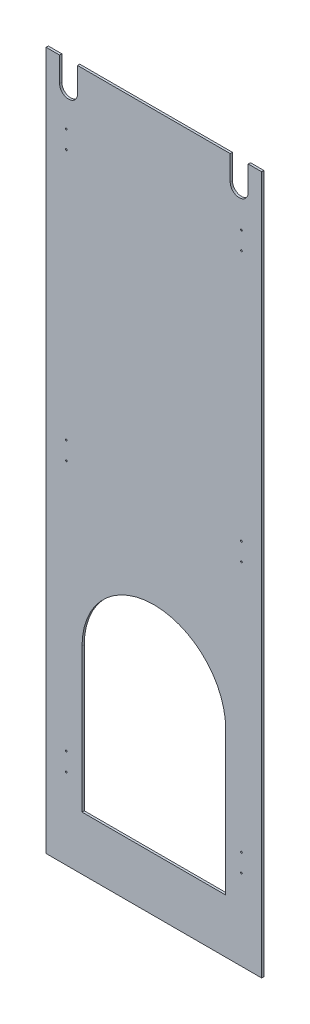
ISO-10303-21;
HEADER;
FILE_DESCRIPTION(('STEP AP214'),'2;1');
FILE_NAME('part.step','',(''),(''),'','','');
FILE_SCHEMA(('AUTOMOTIVE_DESIGN { 1 0 10303 214 1 1 1 1 }'));
ENDSEC;
DATA;
#1=APPLICATION_CONTEXT('core data for automotive mechanical design processes');
#2=APPLICATION_PROTOCOL_DEFINITION('international standard','automotive_design',2000,#1);
#3=PRODUCT_CONTEXT('',#1,'mechanical');
#4=PRODUCT('Part','Part','',(#3));
#5=PRODUCT_RELATED_PRODUCT_CATEGORY('part','',(#4));
#6=PRODUCT_DEFINITION_FORMATION('','',#4);
#7=PRODUCT_DEFINITION_CONTEXT('part definition',#1,'design');
#8=PRODUCT_DEFINITION('design','',#6,#7);
#9=PRODUCT_DEFINITION_SHAPE('','',#8);
#10=(LENGTH_UNIT() NAMED_UNIT(*) SI_UNIT(.MILLI.,.METRE.));
#11=(NAMED_UNIT(*) PLANE_ANGLE_UNIT() SI_UNIT($,.RADIAN.));
#12=(NAMED_UNIT(*) SI_UNIT($,.STERADIAN.) SOLID_ANGLE_UNIT());
#13=UNCERTAINTY_MEASURE_WITH_UNIT(LENGTH_MEASURE(1.E-05),#10,'distance_accuracy_value','');
#14=(GEOMETRIC_REPRESENTATION_CONTEXT(3) GLOBAL_UNCERTAINTY_ASSIGNED_CONTEXT((#13)) GLOBAL_UNIT_ASSIGNED_CONTEXT((#10,
#11,#12)) REPRESENTATION_CONTEXT('',''));
#15=CARTESIAN_POINT('',(0.,0.,0.));
#16=DIRECTION('',(0.,0.,1.));
#17=DIRECTION('',(1.,0.,0.));
#18=AXIS2_PLACEMENT_3D('',#15,#16,#17);
#19=CARTESIAN_POINT('',(0.,0.,0.));
#20=DIRECTION('',(0.,0.,1.));
#21=DIRECTION('',(1.,0.,0.));
#22=AXIS2_PLACEMENT_3D('',#19,#20,#21);
#23=PLANE('',#22);
#24=CARTESIAN_POINT('',(247.65,815.975,0.));
#25=DIRECTION('',(0.,0.,-1.));
#26=DIRECTION('',(-1.,0.,0.));
#27=AXIS2_PLACEMENT_3D('',#24,#25,#26);
#28=CIRCLE('',#27,2.3876);
#29=CARTESIAN_POINT('',(245.2624,815.975,0.));
#30=VERTEX_POINT('',#29);
#31=EDGE_CURVE('E364',#30,#30,#28,.F.);
#32=ORIENTED_EDGE('',*,*,#31,.T.);
#33=EDGE_LOOP('',(#32));
#34=FACE_BOUND('',#33,.T.);
#35=CARTESIAN_POINT('',(247.65,765.175,0.));
#36=DIRECTION('',(0.,0.,-1.));
#37=DIRECTION('',(-1.,0.,0.));
#38=AXIS2_PLACEMENT_3D('',#35,#36,#37);
#39=CIRCLE('',#38,2.3876);
#40=CARTESIAN_POINT('',(245.2624,765.175,0.));
#41=VERTEX_POINT('',#40);
#42=EDGE_CURVE('E367',#41,#41,#39,.F.);
#43=ORIENTED_EDGE('',*,*,#42,.T.);
#44=EDGE_LOOP('',(#43));
#45=FACE_BOUND('',#44,.T.);
#46=CARTESIAN_POINT('',(-247.65,815.975,0.));
#47=DIRECTION('',(0.,0.,-1.));
#48=DIRECTION('',(-1.,0.,0.));
#49=AXIS2_PLACEMENT_3D('',#46,#47,#48);
#50=CIRCLE('',#49,2.3876);
#51=CARTESIAN_POINT('',(-250.0376,815.975,0.));
#52=VERTEX_POINT('',#51);
#53=EDGE_CURVE('E370',#52,#52,#50,.F.);
#54=ORIENTED_EDGE('',*,*,#53,.T.);
#55=EDGE_LOOP('',(#54));
#56=FACE_BOUND('',#55,.T.);
#57=CARTESIAN_POINT('',(-247.65,765.175,0.));
#58=DIRECTION('',(0.,0.,-1.));
#59=DIRECTION('',(-1.,0.,0.));
#60=AXIS2_PLACEMENT_3D('',#57,#58,#59);
#61=CIRCLE('',#60,2.3876);
#62=CARTESIAN_POINT('',(-250.0376,765.175,0.));
#63=VERTEX_POINT('',#62);
#64=EDGE_CURVE('E373',#63,#63,#61,.F.);
#65=ORIENTED_EDGE('',*,*,#64,.T.);
#66=EDGE_LOOP('',(#65));
#67=FACE_BOUND('',#66,.T.);
#68=CARTESIAN_POINT('',(247.65,53.975,0.));
#69=DIRECTION('',(0.,0.,-1.));
#70=DIRECTION('',(-1.,0.,0.));
#71=AXIS2_PLACEMENT_3D('',#68,#69,#70);
#72=CIRCLE('',#71,2.3876);
#73=CARTESIAN_POINT('',(245.2624,53.975,0.));
#74=VERTEX_POINT('',#73);
#75=EDGE_CURVE('E376',#74,#74,#72,.F.);
#76=ORIENTED_EDGE('',*,*,#75,.T.);
#77=EDGE_LOOP('',(#76));
#78=FACE_BOUND('',#77,.T.);
#79=CARTESIAN_POINT('',(247.65,3.175,0.));
#80=DIRECTION('',(0.,0.,-1.));
#81=DIRECTION('',(-1.,0.,0.));
#82=AXIS2_PLACEMENT_3D('',#79,#80,#81);
#83=CIRCLE('',#82,2.3876);
#84=CARTESIAN_POINT('',(245.2624,3.175,0.));
#85=VERTEX_POINT('',#84);
#86=EDGE_CURVE('E379',#85,#85,#83,.F.);
#87=ORIENTED_EDGE('',*,*,#86,.T.);
#88=EDGE_LOOP('',(#87));
#89=FACE_BOUND('',#88,.T.);
#90=CARTESIAN_POINT('',(-247.65,53.975,0.));
#91=DIRECTION('',(0.,0.,-1.));
#92=DIRECTION('',(-1.,0.,0.));
#93=AXIS2_PLACEMENT_3D('',#90,#91,#92);
#94=CIRCLE('',#93,2.3876);
#95=CARTESIAN_POINT('',(-250.0376,53.975,0.));
#96=VERTEX_POINT('',#95);
#97=EDGE_CURVE('E382',#96,#96,#94,.F.);
#98=ORIENTED_EDGE('',*,*,#97,.T.);
#99=EDGE_LOOP('',(#98));
#100=FACE_BOUND('',#99,.T.);
#101=CARTESIAN_POINT('',(-247.65,3.175,0.));
#102=DIRECTION('',(0.,0.,-1.));
#103=DIRECTION('',(-1.,0.,0.));
#104=AXIS2_PLACEMENT_3D('',#101,#102,#103);
#105=CIRCLE('',#104,2.3876);
#106=CARTESIAN_POINT('',(-250.0376,3.175,0.));
#107=VERTEX_POINT('',#106);
#108=EDGE_CURVE('E385',#107,#107,#105,.F.);
#109=ORIENTED_EDGE('',*,*,#108,.T.);
#110=EDGE_LOOP('',(#109));
#111=FACE_BOUND('',#110,.T.);
#112=CARTESIAN_POINT('',(247.65,-708.025,0.));
#113=DIRECTION('',(0.,0.,-1.));
#114=DIRECTION('',(-1.,0.,0.));
#115=AXIS2_PLACEMENT_3D('',#112,#113,#114);
#116=CIRCLE('',#115,2.3876);
#117=CARTESIAN_POINT('',(245.2624,-708.025,0.));
#118=VERTEX_POINT('',#117);
#119=EDGE_CURVE('E388',#118,#118,#116,.F.);
#120=ORIENTED_EDGE('',*,*,#119,.T.);
#121=EDGE_LOOP('',(#120));
#122=FACE_BOUND('',#121,.T.);
#123=CARTESIAN_POINT('',(247.65,-758.825,0.));
#124=DIRECTION('',(0.,0.,-1.));
#125=DIRECTION('',(-1.,0.,0.));
#126=AXIS2_PLACEMENT_3D('',#123,#124,#125);
#127=CIRCLE('',#126,2.3876);
#128=CARTESIAN_POINT('',(245.2624,-758.825,0.));
#129=VERTEX_POINT('',#128);
#130=EDGE_CURVE('E391',#129,#129,#127,.F.);
#131=ORIENTED_EDGE('',*,*,#130,.T.);
#132=EDGE_LOOP('',(#131));
#133=FACE_BOUND('',#132,.T.);
#134=CARTESIAN_POINT('',(-247.65,-708.025,0.));
#135=DIRECTION('',(0.,0.,-1.));
#136=DIRECTION('',(-1.,0.,0.));
#137=AXIS2_PLACEMENT_3D('',#134,#135,#136);
#138=CIRCLE('',#137,2.3876);
#139=CARTESIAN_POINT('',(-250.0376,-708.025,0.));
#140=VERTEX_POINT('',#139);
#141=EDGE_CURVE('E394',#140,#140,#138,.F.);
#142=ORIENTED_EDGE('',*,*,#141,.T.);
#143=EDGE_LOOP('',(#142));
#144=FACE_BOUND('',#143,.T.);
#145=CARTESIAN_POINT('',(-247.65,-758.825,0.));
#146=DIRECTION('',(0.,0.,-1.));
#147=DIRECTION('',(-1.,0.,0.));
#148=AXIS2_PLACEMENT_3D('',#145,#146,#147);
#149=CIRCLE('',#148,2.3876);
#150=CARTESIAN_POINT('',(-250.0376,-758.825,0.));
#151=VERTEX_POINT('',#150);
#152=EDGE_CURVE('E155',#151,#151,#149,.F.);
#153=ORIENTED_EDGE('',*,*,#152,.T.);
#154=EDGE_LOOP('',(#153));
#155=FACE_BOUND('',#154,.T.);
#156=DIRECTION('',(0.,1.,0.));
#157=VECTOR('',#156,1.);
#158=CARTESIAN_POINT('',(-203.2,-428.625,0.));
#159=LINE('',#158,#157);
#160=CARTESIAN_POINT('',(-203.2,-428.625,0.));
#161=VERTEX_POINT('',#160);
#162=CARTESIAN_POINT('',(-203.2,-835.025,0.));
#163=VERTEX_POINT('',#162);
#164=EDGE_CURVE('E205',#161,#163,#159,.F.);
#165=ORIENTED_EDGE('',*,*,#164,.T.);
#166=DIRECTION('',(1.,0.,0.));
#167=VECTOR('',#166,1.);
#168=CARTESIAN_POINT('',(-203.2,-835.025,0.));
#169=LINE('',#168,#167);
#170=CARTESIAN_POINT('',(203.2,-835.025,0.));
#171=VERTEX_POINT('',#170);
#172=EDGE_CURVE('E211',#163,#171,#169,.T.);
#173=ORIENTED_EDGE('',*,*,#172,.T.);
#174=DIRECTION('',(0.,1.,0.));
#175=VECTOR('',#174,1.);
#176=CARTESIAN_POINT('',(203.2,-835.025,0.));
#177=LINE('',#176,#175);
#178=CARTESIAN_POINT('',(203.2,-428.625,0.));
#179=VERTEX_POINT('',#178);
#180=EDGE_CURVE('E154',#171,#179,#177,.T.);
#181=ORIENTED_EDGE('',*,*,#180,.T.);
#182=CARTESIAN_POINT('',(0.,-428.625,0.));
#183=DIRECTION('',(0.,0.,1.));
#184=DIRECTION('',(1.,0.,0.));
#185=AXIS2_PLACEMENT_3D('',#182,#183,#184);
#186=CIRCLE('',#185,203.2);
#187=EDGE_CURVE('E203',#179,#161,#186,.T.);
#188=ORIENTED_EDGE('',*,*,#187,.T.);
#189=EDGE_LOOP('',(#165,#173,#181,#188));
#190=FACE_BOUND('',#189,.T.);
#191=DIRECTION('',(0.,1.,0.));
#192=VECTOR('',#191,1.);
#193=CARTESIAN_POINT('',(304.8,-987.425,0.));
#194=LINE('',#193,#192);
#195=CARTESIAN_POINT('',(304.8,-987.425,0.));
#196=VERTEX_POINT('',#195);
#197=CARTESIAN_POINT('',(304.8,987.425,0.));
#198=VERTEX_POINT('',#197);
#199=EDGE_CURVE('E226',#196,#198,#194,.T.);
#200=ORIENTED_EDGE('',*,*,#199,.F.);
#201=DIRECTION('',(1.,0.,0.));
#202=VECTOR('',#201,1.);
#203=CARTESIAN_POINT('',(-304.8,-987.425,0.));
#204=LINE('',#203,#202);
#205=CARTESIAN_POINT('',(-304.8,-987.425,0.));
#206=VERTEX_POINT('',#205);
#207=EDGE_CURVE('E237',#206,#196,#204,.T.);
#208=ORIENTED_EDGE('',*,*,#207,.F.);
#209=DIRECTION('',(0.,1.,0.));
#210=VECTOR('',#209,1.);
#211=CARTESIAN_POINT('',(-304.8,987.425,0.));
#212=LINE('',#211,#210);
#213=CARTESIAN_POINT('',(-304.8,987.425,0.));
#214=VERTEX_POINT('',#213);
#215=EDGE_CURVE('E248',#214,#206,#212,.F.);
#216=ORIENTED_EDGE('',*,*,#215,.F.);
#217=DIRECTION('',(1.,0.,0.));
#218=VECTOR('',#217,1.);
#219=CARTESIAN_POINT('',(304.8,987.425,0.));
#220=LINE('',#219,#218);
#221=CARTESIAN_POINT('',(-266.7,987.425,0.));
#222=VERTEX_POINT('',#221);
#223=EDGE_CURVE('E267',#222,#214,#220,.F.);
#224=ORIENTED_EDGE('',*,*,#223,.F.);
#225=DIRECTION('',(0.,1.,0.));
#226=VECTOR('',#225,1.);
#227=CARTESIAN_POINT('',(-266.7,917.575,0.));
#228=LINE('',#227,#226);
#229=CARTESIAN_POINT('',(-266.7,917.575,0.));
#230=VERTEX_POINT('',#229);
#231=EDGE_CURVE('E272',#222,#230,#228,.F.);
#232=ORIENTED_EDGE('',*,*,#231,.T.);
#233=CARTESIAN_POINT('',(-241.3,917.575,0.));
#234=DIRECTION('',(0.,0.,-1.));
#235=DIRECTION('',(-1.,0.,0.));
#236=AXIS2_PLACEMENT_3D('',#233,#234,#235);
#237=CIRCLE('',#236,25.4);
#238=CARTESIAN_POINT('',(-215.9,917.575,0.));
#239=VERTEX_POINT('',#238);
#240=EDGE_CURVE('E275',#230,#239,#237,.F.);
#241=ORIENTED_EDGE('',*,*,#240,.T.);
#242=DIRECTION('',(0.,1.,0.));
#243=VECTOR('',#242,1.);
#244=CARTESIAN_POINT('',(-215.9,987.425,0.));
#245=LINE('',#244,#243);
#246=CARTESIAN_POINT('',(-215.9,987.425,0.));
#247=VERTEX_POINT('',#246);
#248=EDGE_CURVE('E278',#239,#247,#245,.T.);
#249=ORIENTED_EDGE('',*,*,#248,.T.);
#250=DIRECTION('',(1.,0.,0.));
#251=VECTOR('',#250,1.);
#252=CARTESIAN_POINT('',(304.8,987.425,0.));
#253=LINE('',#252,#251);
#254=CARTESIAN_POINT('',(215.9,987.425,0.));
#255=VERTEX_POINT('',#254);
#256=EDGE_CURVE('E83',#255,#247,#253,.F.);
#257=ORIENTED_EDGE('',*,*,#256,.F.);
#258=DIRECTION('',(0.,1.,0.));
#259=VECTOR('',#258,1.);
#260=CARTESIAN_POINT('',(215.9,917.575,0.));
#261=LINE('',#260,#259);
#262=CARTESIAN_POINT('',(215.9,917.575,0.));
#263=VERTEX_POINT('',#262);
#264=EDGE_CURVE('E79',#255,#263,#261,.F.);
#265=ORIENTED_EDGE('',*,*,#264,.T.);
#266=CARTESIAN_POINT('',(241.3,917.575,0.));
#267=DIRECTION('',(0.,0.,-1.));
#268=DIRECTION('',(-1.,0.,0.));
#269=AXIS2_PLACEMENT_3D('',#266,#267,#268);
#270=CIRCLE('',#269,25.4);
#271=CARTESIAN_POINT('',(266.7,917.575,0.));
#272=VERTEX_POINT('',#271);
#273=EDGE_CURVE('E20',#263,#272,#270,.F.);
#274=ORIENTED_EDGE('',*,*,#273,.T.);
#275=DIRECTION('',(0.,1.,0.));
#276=VECTOR('',#275,1.);
#277=CARTESIAN_POINT('',(266.7,987.425,0.));
#278=LINE('',#277,#276);
#279=CARTESIAN_POINT('',(266.7,987.425,0.));
#280=VERTEX_POINT('',#279);
#281=EDGE_CURVE('E214',#272,#280,#278,.T.);
#282=ORIENTED_EDGE('',*,*,#281,.T.);
#283=DIRECTION('',(1.,0.,0.));
#284=VECTOR('',#283,1.);
#285=CARTESIAN_POINT('',(304.8,987.425,0.));
#286=LINE('',#285,#284);
#287=EDGE_CURVE('E225',#198,#280,#286,.F.);
#288=ORIENTED_EDGE('',*,*,#287,.F.);
#289=EDGE_LOOP('',(#200,#208,#216,#224,#232,#241,#249,#257,#265,#274,#282,#288));
#290=FACE_BOUND('',#289,.T.);
#291=ADVANCED_FACE('F17',(#34,#45,#56,#67,#78,#89,#100,#111,#122,#133,#144,#155,#190,#290),#23,.F.);
#292=CARTESIAN_POINT('',(241.3,917.575,0.));
#293=DIRECTION('',(0.,0.,-1.));
#294=DIRECTION('',(-1.,0.,0.));
#295=AXIS2_PLACEMENT_3D('',#292,#293,#294);
#296=CYLINDRICAL_SURFACE('',#295,25.4);
#297=CARTESIAN_POINT('',(241.3,917.575,6.35));
#298=DIRECTION('',(0.,0.,-1.));
#299=DIRECTION('',(-1.,0.,0.));
#300=AXIS2_PLACEMENT_3D('',#297,#298,#299);
#301=CIRCLE('',#300,25.4);
#302=CARTESIAN_POINT('',(266.7,917.575,6.35));
#303=VERTEX_POINT('',#302);
#304=CARTESIAN_POINT('',(215.9,917.575,6.35));
#305=VERTEX_POINT('',#304);
#306=EDGE_CURVE('E193',#303,#305,#301,.T.);
#307=ORIENTED_EDGE('',*,*,#306,.F.);
#308=DIRECTION('',(0.,0.,-1.));
#309=VECTOR('',#308,1.);
#310=CARTESIAN_POINT('',(266.7,917.575,0.));
#311=LINE('',#310,#309);
#312=EDGE_CURVE('E208',#303,#272,#311,.T.);
#313=ORIENTED_EDGE('',*,*,#312,.T.);
#314=ORIENTED_EDGE('',*,*,#273,.F.);
#315=DIRECTION('',(0.,0.,1.));
#316=VECTOR('',#315,1.);
#317=CARTESIAN_POINT('',(215.9,917.575,0.));
#318=LINE('',#317,#316);
#319=EDGE_CURVE('E290',#263,#305,#318,.T.);
#320=ORIENTED_EDGE('',*,*,#319,.T.);
#321=EDGE_LOOP('',(#307,#313,#314,#320));
#322=FACE_BOUND('',#321,.T.);
#323=ADVANCED_FACE('F421',(#322),#296,.F.);
#324=CARTESIAN_POINT('',(215.9,917.575,0.));
#325=DIRECTION('',(-1.,0.,0.));
#326=DIRECTION('',(0.,0.,1.));
#327=AXIS2_PLACEMENT_3D('',#324,#325,#326);
#328=PLANE('',#327);
#329=DIRECTION('',(0.,1.,0.));
#330=VECTOR('',#329,1.);
#331=CARTESIAN_POINT('',(215.9,0.,6.35));
#332=LINE('',#331,#330);
#333=CARTESIAN_POINT('',(215.9,987.425,6.35));
#334=VERTEX_POINT('',#333);
#335=EDGE_CURVE('E190',#305,#334,#332,.T.);
#336=ORIENTED_EDGE('',*,*,#335,.F.);
#337=ORIENTED_EDGE('',*,*,#319,.F.);
#338=ORIENTED_EDGE('',*,*,#264,.F.);
#339=DIRECTION('',(0.,0.,1.));
#340=VECTOR('',#339,1.);
#341=CARTESIAN_POINT('',(215.9,987.425,0.));
#342=LINE('',#341,#340);
#343=EDGE_CURVE('E285',#334,#255,#342,.F.);
#344=ORIENTED_EDGE('',*,*,#343,.F.);
#345=EDGE_LOOP('',(#336,#337,#338,#344));
#346=FACE_BOUND('',#345,.T.);
#347=ADVANCED_FACE('F418',(#346),#328,.F.);
#348=CARTESIAN_POINT('',(304.8,987.425,0.));
#349=DIRECTION('',(0.,1.,0.));
#350=DIRECTION('',(0.,0.,1.));
#351=AXIS2_PLACEMENT_3D('',#348,#349,#350);
#352=PLANE('',#351);
#353=DIRECTION('',(1.,0.,0.));
#354=VECTOR('',#353,1.);
#355=CARTESIAN_POINT('',(0.,987.425,6.35));
#356=LINE('',#355,#354);
#357=CARTESIAN_POINT('',(-215.9,987.425,6.35));
#358=VERTEX_POINT('',#357);
#359=EDGE_CURVE('E187',#334,#358,#356,.F.);
#360=ORIENTED_EDGE('',*,*,#359,.F.);
#361=ORIENTED_EDGE('',*,*,#343,.T.);
#362=ORIENTED_EDGE('',*,*,#256,.T.);
#363=DIRECTION('',(0.,0.,-1.));
#364=VECTOR('',#363,1.);
#365=CARTESIAN_POINT('',(-215.9,987.425,0.));
#366=LINE('',#365,#364);
#367=EDGE_CURVE('E276',#247,#358,#366,.F.);
#368=ORIENTED_EDGE('',*,*,#367,.T.);
#369=EDGE_LOOP('',(#360,#361,#362,#368));
#370=FACE_BOUND('',#369,.T.);
#371=ADVANCED_FACE('F416',(#370),#352,.T.);
#372=CARTESIAN_POINT('',(-215.9,987.425,0.));
#373=DIRECTION('',(1.,0.,0.));
#374=DIRECTION('',(0.,0.,-1.));
#375=AXIS2_PLACEMENT_3D('',#372,#373,#374);
#376=PLANE('',#375);
#377=DIRECTION('',(0.,1.,0.));
#378=VECTOR('',#377,1.);
#379=CARTESIAN_POINT('',(-215.9,0.,6.35));
#380=LINE('',#379,#378);
#381=CARTESIAN_POINT('',(-215.9,917.575,6.35));
#382=VERTEX_POINT('',#381);
#383=EDGE_CURVE('E184',#358,#382,#380,.F.);
#384=ORIENTED_EDGE('',*,*,#383,.F.);
#385=ORIENTED_EDGE('',*,*,#367,.F.);
#386=ORIENTED_EDGE('',*,*,#248,.F.);
#387=DIRECTION('',(0.,0.,-1.));
#388=VECTOR('',#387,1.);
#389=CARTESIAN_POINT('',(-215.9,917.575,0.));
#390=LINE('',#389,#388);
#391=EDGE_CURVE('E273',#239,#382,#390,.F.);
#392=ORIENTED_EDGE('',*,*,#391,.T.);
#393=EDGE_LOOP('',(#384,#385,#386,#392));
#394=FACE_BOUND('',#393,.T.);
#395=ADVANCED_FACE('F409',(#394),#376,.F.);
#396=CARTESIAN_POINT('',(-241.3,917.575,0.));
#397=DIRECTION('',(0.,0.,-1.));
#398=DIRECTION('',(-1.,0.,0.));
#399=AXIS2_PLACEMENT_3D('',#396,#397,#398);
#400=CYLINDRICAL_SURFACE('',#399,25.4);
#401=CARTESIAN_POINT('',(-241.3,917.575,6.35));
#402=DIRECTION('',(0.,0.,-1.));
#403=DIRECTION('',(-1.,0.,0.));
#404=AXIS2_PLACEMENT_3D('',#401,#402,#403);
#405=CIRCLE('',#404,25.4);
#406=CARTESIAN_POINT('',(-266.7,917.575,6.35));
#407=VERTEX_POINT('',#406);
#408=EDGE_CURVE('E181',#382,#407,#405,.T.);
#409=ORIENTED_EDGE('',*,*,#408,.F.);
#410=ORIENTED_EDGE('',*,*,#391,.F.);
#411=ORIENTED_EDGE('',*,*,#240,.F.);
#412=DIRECTION('',(0.,0.,1.));
#413=VECTOR('',#412,1.);
#414=CARTESIAN_POINT('',(-266.7,917.575,0.));
#415=LINE('',#414,#413);
#416=EDGE_CURVE('E270',#230,#407,#415,.T.);
#417=ORIENTED_EDGE('',*,*,#416,.T.);
#418=EDGE_LOOP('',(#409,#410,#411,#417));
#419=FACE_BOUND('',#418,.T.);
#420=ADVANCED_FACE('F411',(#419),#400,.F.);
#421=CARTESIAN_POINT('',(-266.7,917.575,0.));
#422=DIRECTION('',(-1.,0.,0.));
#423=DIRECTION('',(0.,0.,1.));
#424=AXIS2_PLACEMENT_3D('',#421,#422,#423);
#425=PLANE('',#424);
#426=DIRECTION('',(0.,1.,0.));
#427=VECTOR('',#426,1.);
#428=CARTESIAN_POINT('',(-266.7,0.,6.35));
#429=LINE('',#428,#427);
#430=CARTESIAN_POINT('',(-266.7,987.425,6.35));
#431=VERTEX_POINT('',#430);
#432=EDGE_CURVE('E177',#407,#431,#429,.T.);
#433=ORIENTED_EDGE('',*,*,#432,.F.);
#434=ORIENTED_EDGE('',*,*,#416,.F.);
#435=ORIENTED_EDGE('',*,*,#231,.F.);
#436=DIRECTION('',(0.,0.,1.));
#437=VECTOR('',#436,1.);
#438=CARTESIAN_POINT('',(-266.7,987.425,0.));
#439=LINE('',#438,#437);
#440=EDGE_CURVE('E258',#431,#222,#439,.F.);
#441=ORIENTED_EDGE('',*,*,#440,.F.);
#442=EDGE_LOOP('',(#433,#434,#435,#441));
#443=FACE_BOUND('',#442,.T.);
#444=ADVANCED_FACE('F447',(#443),#425,.F.);
#445=CARTESIAN_POINT('',(304.8,987.425,0.));
#446=DIRECTION('',(0.,1.,0.));
#447=DIRECTION('',(0.,0.,1.));
#448=AXIS2_PLACEMENT_3D('',#445,#446,#447);
#449=PLANE('',#448);
#450=DIRECTION('',(1.,0.,0.));
#451=VECTOR('',#450,1.);
#452=CARTESIAN_POINT('',(0.,987.425,6.35));
#453=LINE('',#452,#451);
#454=CARTESIAN_POINT('',(-304.8,987.425,6.35));
#455=VERTEX_POINT('',#454);
#456=EDGE_CURVE('E180',#431,#455,#453,.F.);
#457=ORIENTED_EDGE('',*,*,#456,.F.);
#458=ORIENTED_EDGE('',*,*,#440,.T.);
#459=ORIENTED_EDGE('',*,*,#223,.T.);
#460=DIRECTION('',(0.,0.,1.));
#461=VECTOR('',#460,1.);
#462=CARTESIAN_POINT('',(-304.8,987.425,0.));
#463=LINE('',#462,#461);
#464=EDGE_CURVE('E255',#455,#214,#463,.F.);
#465=ORIENTED_EDGE('',*,*,#464,.F.);
#466=EDGE_LOOP('',(#457,#458,#459,#465));
#467=FACE_BOUND('',#466,.T.);
#468=ADVANCED_FACE('F445',(#467),#449,.T.);
#469=CARTESIAN_POINT('',(-304.8,987.425,0.));
#470=DIRECTION('',(-1.,0.,0.));
#471=DIRECTION('',(0.,0.,1.));
#472=AXIS2_PLACEMENT_3D('',#469,#470,#471);
#473=PLANE('',#472);
#474=ORIENTED_EDGE('',*,*,#464,.T.);
#475=ORIENTED_EDGE('',*,*,#215,.T.);
#476=DIRECTION('',(0.,0.,-1.));
#477=VECTOR('',#476,1.);
#478=CARTESIAN_POINT('',(-304.8,-987.425,0.));
#479=LINE('',#478,#477);
#480=CARTESIAN_POINT('',(-304.8,-987.425,6.35));
#481=VERTEX_POINT('',#480);
#482=EDGE_CURVE('E245',#481,#206,#479,.T.);
#483=ORIENTED_EDGE('',*,*,#482,.F.);
#484=DIRECTION('',(0.,1.,0.));
#485=VECTOR('',#484,1.);
#486=CARTESIAN_POINT('',(-304.8,0.,6.35));
#487=LINE('',#486,#485);
#488=EDGE_CURVE('E242',#455,#481,#487,.F.);
#489=ORIENTED_EDGE('',*,*,#488,.F.);
#490=EDGE_LOOP('',(#474,#475,#483,#489));
#491=FACE_BOUND('',#490,.T.);
#492=ADVANCED_FACE('F442',(#491),#473,.T.);
#493=CARTESIAN_POINT('',(-304.8,-987.425,0.));
#494=DIRECTION('',(0.,-1.,0.));
#495=DIRECTION('',(0.,0.,-1.));
#496=AXIS2_PLACEMENT_3D('',#493,#494,#495);
#497=PLANE('',#496);
#498=ORIENTED_EDGE('',*,*,#482,.T.);
#499=ORIENTED_EDGE('',*,*,#207,.T.);
#500=DIRECTION('',(0.,0.,-1.));
#501=VECTOR('',#500,1.);
#502=CARTESIAN_POINT('',(304.8,-987.425,0.));
#503=LINE('',#502,#501);
#504=CARTESIAN_POINT('',(304.8,-987.425,6.35));
#505=VERTEX_POINT('',#504);
#506=EDGE_CURVE('E234',#505,#196,#503,.T.);
#507=ORIENTED_EDGE('',*,*,#506,.F.);
#508=DIRECTION('',(1.,0.,0.));
#509=VECTOR('',#508,1.);
#510=CARTESIAN_POINT('',(0.,-987.425,6.35));
#511=LINE('',#510,#509);
#512=EDGE_CURVE('E231',#481,#505,#511,.T.);
#513=ORIENTED_EDGE('',*,*,#512,.F.);
#514=EDGE_LOOP('',(#498,#499,#507,#513));
#515=FACE_BOUND('',#514,.T.);
#516=ADVANCED_FACE('F439',(#515),#497,.T.);
#517=CARTESIAN_POINT('',(304.8,-987.425,0.));
#518=DIRECTION('',(1.,0.,0.));
#519=DIRECTION('',(0.,0.,-1.));
#520=AXIS2_PLACEMENT_3D('',#517,#518,#519);
#521=PLANE('',#520);
#522=ORIENTED_EDGE('',*,*,#506,.T.);
#523=ORIENTED_EDGE('',*,*,#199,.T.);
#524=DIRECTION('',(0.,0.,1.));
#525=VECTOR('',#524,1.);
#526=CARTESIAN_POINT('',(304.8,987.425,0.));
#527=LINE('',#526,#525);
#528=CARTESIAN_POINT('',(304.8,987.425,6.35));
#529=VERTEX_POINT('',#528);
#530=EDGE_CURVE('E222',#529,#198,#527,.F.);
#531=ORIENTED_EDGE('',*,*,#530,.F.);
#532=DIRECTION('',(0.,1.,0.));
#533=VECTOR('',#532,1.);
#534=CARTESIAN_POINT('',(304.8,0.,6.35));
#535=LINE('',#534,#533);
#536=EDGE_CURVE('E219',#505,#529,#535,.T.);
#537=ORIENTED_EDGE('',*,*,#536,.F.);
#538=EDGE_LOOP('',(#522,#523,#531,#537));
#539=FACE_BOUND('',#538,.T.);
#540=ADVANCED_FACE('F435',(#539),#521,.T.);
#541=CARTESIAN_POINT('',(304.8,987.425,0.));
#542=DIRECTION('',(0.,1.,0.));
#543=DIRECTION('',(0.,0.,1.));
#544=AXIS2_PLACEMENT_3D('',#541,#542,#543);
#545=PLANE('',#544);
#546=ORIENTED_EDGE('',*,*,#287,.T.);
#547=DIRECTION('',(0.,0.,-1.));
#548=VECTOR('',#547,1.);
#549=CARTESIAN_POINT('',(266.7,987.425,0.));
#550=LINE('',#549,#548);
#551=CARTESIAN_POINT('',(266.7,987.425,6.35));
#552=VERTEX_POINT('',#551);
#553=EDGE_CURVE('E212',#280,#552,#550,.F.);
#554=ORIENTED_EDGE('',*,*,#553,.T.);
#555=DIRECTION('',(1.,0.,0.));
#556=VECTOR('',#555,1.);
#557=CARTESIAN_POINT('',(0.,987.425,6.35));
#558=LINE('',#557,#556);
#559=EDGE_CURVE('E174',#529,#552,#558,.F.);
#560=ORIENTED_EDGE('',*,*,#559,.F.);
#561=ORIENTED_EDGE('',*,*,#530,.T.);
#562=EDGE_LOOP('',(#546,#554,#560,#561));
#563=FACE_BOUND('',#562,.T.);
#564=ADVANCED_FACE('F428',(#563),#545,.T.);
#565=CARTESIAN_POINT('',(266.7,987.425,0.));
#566=DIRECTION('',(1.,0.,0.));
#567=DIRECTION('',(0.,0.,-1.));
#568=AXIS2_PLACEMENT_3D('',#565,#566,#567);
#569=PLANE('',#568);
#570=DIRECTION('',(0.,1.,0.));
#571=VECTOR('',#570,1.);
#572=CARTESIAN_POINT('',(266.7,0.,6.35));
#573=LINE('',#572,#571);
#574=EDGE_CURVE('E148',#552,#303,#573,.F.);
#575=ORIENTED_EDGE('',*,*,#574,.F.);
#576=ORIENTED_EDGE('',*,*,#553,.F.);
#577=ORIENTED_EDGE('',*,*,#281,.F.);
#578=ORIENTED_EDGE('',*,*,#312,.F.);
#579=EDGE_LOOP('',(#575,#576,#577,#578));
#580=FACE_BOUND('',#579,.T.);
#581=ADVANCED_FACE('F431',(#580),#569,.F.);
#582=CARTESIAN_POINT('',(-203.2,-835.025,6.35));
#583=DIRECTION('',(0.,-1.,0.));
#584=DIRECTION('',(0.,0.,-1.));
#585=AXIS2_PLACEMENT_3D('',#582,#583,#584);
#586=PLANE('',#585);
#587=DIRECTION('',(1.,0.,0.));
#588=VECTOR('',#587,1.);
#589=CARTESIAN_POINT('',(0.,-835.025,6.35));
#590=LINE('',#589,#588);
#591=CARTESIAN_POINT('',(203.2,-835.025,6.35));
#592=VERTEX_POINT('',#591);
#593=CARTESIAN_POINT('',(-203.2,-835.025,6.35));
#594=VERTEX_POINT('',#593);
#595=EDGE_CURVE('E135',#592,#594,#590,.F.);
#596=ORIENTED_EDGE('',*,*,#595,.F.);
#597=DIRECTION('',(0.,0.,-1.));
#598=VECTOR('',#597,1.);
#599=CARTESIAN_POINT('',(203.2,-835.025,6.35));
#600=LINE('',#599,#598);
#601=EDGE_CURVE('E139',#592,#171,#600,.T.);
#602=ORIENTED_EDGE('',*,*,#601,.T.);
#603=ORIENTED_EDGE('',*,*,#172,.F.);
#604=DIRECTION('',(0.,0.,1.));
#605=VECTOR('',#604,1.);
#606=CARTESIAN_POINT('',(-203.2,-835.025,6.35));
#607=LINE('',#606,#605);
#608=EDGE_CURVE('E142',#163,#594,#607,.T.);
#609=ORIENTED_EDGE('',*,*,#608,.T.);
#610=EDGE_LOOP('',(#596,#602,#603,#609));
#611=FACE_BOUND('',#610,.T.);
#612=ADVANCED_FACE('F137',(#611),#586,.F.);
#613=CARTESIAN_POINT('',(-203.2,-428.625,6.35));
#614=DIRECTION('',(-1.,0.,0.));
#615=DIRECTION('',(0.,0.,1.));
#616=AXIS2_PLACEMENT_3D('',#613,#614,#615);
#617=PLANE('',#616);
#618=DIRECTION('',(0.,1.,0.));
#619=VECTOR('',#618,1.);
#620=CARTESIAN_POINT('',(-203.2,0.,6.35));
#621=LINE('',#620,#619);
#622=CARTESIAN_POINT('',(-203.2,-428.625,6.35));
#623=VERTEX_POINT('',#622);
#624=EDGE_CURVE('E147',#594,#623,#621,.T.);
#625=ORIENTED_EDGE('',*,*,#624,.F.);
#626=ORIENTED_EDGE('',*,*,#608,.F.);
#627=ORIENTED_EDGE('',*,*,#164,.F.);
#628=DIRECTION('',(0.,0.,1.));
#629=VECTOR('',#628,1.);
#630=CARTESIAN_POINT('',(-203.2,-428.625,6.35));
#631=LINE('',#630,#629);
#632=EDGE_CURVE('E201',#161,#623,#631,.T.);
#633=ORIENTED_EDGE('',*,*,#632,.T.);
#634=EDGE_LOOP('',(#625,#626,#627,#633));
#635=FACE_BOUND('',#634,.T.);
#636=ADVANCED_FACE('F517',(#635),#617,.F.);
#637=CARTESIAN_POINT('',(0.,-428.625,6.35));
#638=DIRECTION('',(0.,0.,1.));
#639=DIRECTION('',(1.,0.,0.));
#640=AXIS2_PLACEMENT_3D('',#637,#638,#639);
#641=CYLINDRICAL_SURFACE('',#640,203.2);
#642=CARTESIAN_POINT('',(0.,-428.625,6.35));
#643=DIRECTION('',(0.,0.,1.));
#644=DIRECTION('',(1.,0.,0.));
#645=AXIS2_PLACEMENT_3D('',#642,#643,#644);
#646=CIRCLE('',#645,203.2);
#647=CARTESIAN_POINT('',(203.2,-428.625,6.35));
#648=VERTEX_POINT('',#647);
#649=EDGE_CURVE('E159',#623,#648,#646,.F.);
#650=ORIENTED_EDGE('',*,*,#649,.F.);
#651=ORIENTED_EDGE('',*,*,#632,.F.);
#652=ORIENTED_EDGE('',*,*,#187,.F.);
#653=DIRECTION('',(0.,0.,-1.));
#654=VECTOR('',#653,1.);
#655=CARTESIAN_POINT('',(203.2,-428.625,6.35));
#656=LINE('',#655,#654);
#657=EDGE_CURVE('E35',#179,#648,#656,.F.);
#658=ORIENTED_EDGE('',*,*,#657,.T.);
#659=EDGE_LOOP('',(#650,#651,#652,#658));
#660=FACE_BOUND('',#659,.T.);
#661=ADVANCED_FACE('F514',(#660),#641,.F.);
#662=CARTESIAN_POINT('',(203.2,-835.025,6.35));
#663=DIRECTION('',(1.,0.,0.));
#664=DIRECTION('',(0.,0.,-1.));
#665=AXIS2_PLACEMENT_3D('',#662,#663,#664);
#666=PLANE('',#665);
#667=DIRECTION('',(0.,1.,0.));
#668=VECTOR('',#667,1.);
#669=CARTESIAN_POINT('',(203.2,0.,6.35));
#670=LINE('',#669,#668);
#671=EDGE_CURVE('E152',#648,#592,#670,.F.);
#672=ORIENTED_EDGE('',*,*,#671,.F.);
#673=ORIENTED_EDGE('',*,*,#657,.F.);
#674=ORIENTED_EDGE('',*,*,#180,.F.);
#675=ORIENTED_EDGE('',*,*,#601,.F.);
#676=EDGE_LOOP('',(#672,#673,#674,#675));
#677=FACE_BOUND('',#676,.T.);
#678=ADVANCED_FACE('F151',(#677),#666,.F.);
#679=CARTESIAN_POINT('',(-247.65,-758.825,0.));
#680=DIRECTION('',(0.,0.,-1.));
#681=DIRECTION('',(-1.,0.,0.));
#682=AXIS2_PLACEMENT_3D('',#679,#680,#681);
#683=CYLINDRICAL_SURFACE('',#682,2.3876);
#684=CARTESIAN_POINT('',(-247.65,-758.825,6.35));
#685=DIRECTION('',(0.,0.,-1.));
#686=DIRECTION('',(-1.,0.,0.));
#687=AXIS2_PLACEMENT_3D('',#684,#685,#686);
#688=CIRCLE('',#687,2.3876);
#689=CARTESIAN_POINT('',(-250.0376,-758.825,6.35));
#690=VERTEX_POINT('',#689);
#691=EDGE_CURVE('E160',#690,#690,#688,.T.);
#692=ORIENTED_EDGE('',*,*,#691,.F.);
#693=EDGE_LOOP('',(#692));
#694=FACE_BOUND('',#693,.T.);
#695=ORIENTED_EDGE('',*,*,#152,.F.);
#696=EDGE_LOOP('',(#695));
#697=FACE_BOUND('',#696,.T.);
#698=ADVANCED_FACE('F507',(#694,#697),#683,.F.);
#699=CARTESIAN_POINT('',(-247.65,-708.025,0.));
#700=DIRECTION('',(0.,0.,-1.));
#701=DIRECTION('',(-1.,0.,0.));
#702=AXIS2_PLACEMENT_3D('',#699,#700,#701);
#703=CYLINDRICAL_SURFACE('',#702,2.3876);
#704=CARTESIAN_POINT('',(-247.65,-708.025,6.35));
#705=DIRECTION('',(0.,0.,-1.));
#706=DIRECTION('',(-1.,0.,0.));
#707=AXIS2_PLACEMENT_3D('',#704,#705,#706);
#708=CIRCLE('',#707,2.3876);
#709=CARTESIAN_POINT('',(-250.0376,-708.025,6.35));
#710=VERTEX_POINT('',#709);
#711=EDGE_CURVE('E163',#710,#710,#708,.T.);
#712=ORIENTED_EDGE('',*,*,#711,.F.);
#713=EDGE_LOOP('',(#712));
#714=FACE_BOUND('',#713,.T.);
#715=ORIENTED_EDGE('',*,*,#141,.F.);
#716=EDGE_LOOP('',(#715));
#717=FACE_BOUND('',#716,.T.);
#718=ADVANCED_FACE('F503',(#714,#717),#703,.F.);
#719=CARTESIAN_POINT('',(247.65,-758.825,0.));
#720=DIRECTION('',(0.,0.,-1.));
#721=DIRECTION('',(-1.,0.,0.));
#722=AXIS2_PLACEMENT_3D('',#719,#720,#721);
#723=CYLINDRICAL_SURFACE('',#722,2.3876);
#724=CARTESIAN_POINT('',(247.65,-758.825,6.35));
#725=DIRECTION('',(0.,0.,-1.));
#726=DIRECTION('',(-1.,0.,0.));
#727=AXIS2_PLACEMENT_3D('',#724,#725,#726);
#728=CIRCLE('',#727,2.3876);
#729=CARTESIAN_POINT('',(245.2624,-758.825,6.35));
#730=VERTEX_POINT('',#729);
#731=EDGE_CURVE('E355',#730,#730,#728,.T.);
#732=ORIENTED_EDGE('',*,*,#731,.F.);
#733=EDGE_LOOP('',(#732));
#734=FACE_BOUND('',#733,.T.);
#735=ORIENTED_EDGE('',*,*,#130,.F.);
#736=EDGE_LOOP('',(#735));
#737=FACE_BOUND('',#736,.T.);
#738=ADVANCED_FACE('F499',(#734,#737),#723,.F.);
#739=CARTESIAN_POINT('',(247.65,-708.025,0.));
#740=DIRECTION('',(0.,0.,-1.));
#741=DIRECTION('',(-1.,0.,0.));
#742=AXIS2_PLACEMENT_3D('',#739,#740,#741);
#743=CYLINDRICAL_SURFACE('',#742,2.3876);
#744=CARTESIAN_POINT('',(247.65,-708.025,6.35));
#745=DIRECTION('',(0.,0.,-1.));
#746=DIRECTION('',(-1.,0.,0.));
#747=AXIS2_PLACEMENT_3D('',#744,#745,#746);
#748=CIRCLE('',#747,2.3876);
#749=CARTESIAN_POINT('',(245.2624,-708.025,6.35));
#750=VERTEX_POINT('',#749);
#751=EDGE_CURVE('E352',#750,#750,#748,.T.);
#752=ORIENTED_EDGE('',*,*,#751,.F.);
#753=EDGE_LOOP('',(#752));
#754=FACE_BOUND('',#753,.T.);
#755=ORIENTED_EDGE('',*,*,#119,.F.);
#756=EDGE_LOOP('',(#755));
#757=FACE_BOUND('',#756,.T.);
#758=ADVANCED_FACE('F495',(#754,#757),#743,.F.);
#759=CARTESIAN_POINT('',(-247.65,3.175,0.));
#760=DIRECTION('',(0.,0.,-1.));
#761=DIRECTION('',(-1.,0.,0.));
#762=AXIS2_PLACEMENT_3D('',#759,#760,#761);
#763=CYLINDRICAL_SURFACE('',#762,2.3876);
#764=CARTESIAN_POINT('',(-247.65,3.175,6.35));
#765=DIRECTION('',(0.,0.,-1.));
#766=DIRECTION('',(-1.,0.,0.));
#767=AXIS2_PLACEMENT_3D('',#764,#765,#766);
#768=CIRCLE('',#767,2.3876);
#769=CARTESIAN_POINT('',(-250.0376,3.175,6.35));
#770=VERTEX_POINT('',#769);
#771=EDGE_CURVE('E349',#770,#770,#768,.T.);
#772=ORIENTED_EDGE('',*,*,#771,.F.);
#773=EDGE_LOOP('',(#772));
#774=FACE_BOUND('',#773,.T.);
#775=ORIENTED_EDGE('',*,*,#108,.F.);
#776=EDGE_LOOP('',(#775));
#777=FACE_BOUND('',#776,.T.);
#778=ADVANCED_FACE('F491',(#774,#777),#763,.F.);
#779=CARTESIAN_POINT('',(-247.65,53.975,0.));
#780=DIRECTION('',(0.,0.,-1.));
#781=DIRECTION('',(-1.,0.,0.));
#782=AXIS2_PLACEMENT_3D('',#779,#780,#781);
#783=CYLINDRICAL_SURFACE('',#782,2.3876);
#784=CARTESIAN_POINT('',(-247.65,53.975,6.35));
#785=DIRECTION('',(0.,0.,-1.));
#786=DIRECTION('',(-1.,0.,0.));
#787=AXIS2_PLACEMENT_3D('',#784,#785,#786);
#788=CIRCLE('',#787,2.3876);
#789=CARTESIAN_POINT('',(-250.0376,53.975,6.35));
#790=VERTEX_POINT('',#789);
#791=EDGE_CURVE('E346',#790,#790,#788,.T.);
#792=ORIENTED_EDGE('',*,*,#791,.F.);
#793=EDGE_LOOP('',(#792));
#794=FACE_BOUND('',#793,.T.);
#795=ORIENTED_EDGE('',*,*,#97,.F.);
#796=EDGE_LOOP('',(#795));
#797=FACE_BOUND('',#796,.T.);
#798=ADVANCED_FACE('F487',(#794,#797),#783,.F.);
#799=CARTESIAN_POINT('',(247.65,3.175,0.));
#800=DIRECTION('',(0.,0.,-1.));
#801=DIRECTION('',(-1.,0.,0.));
#802=AXIS2_PLACEMENT_3D('',#799,#800,#801);
#803=CYLINDRICAL_SURFACE('',#802,2.3876);
#804=CARTESIAN_POINT('',(247.65,3.175,6.35));
#805=DIRECTION('',(0.,0.,-1.));
#806=DIRECTION('',(-1.,0.,0.));
#807=AXIS2_PLACEMENT_3D('',#804,#805,#806);
#808=CIRCLE('',#807,2.3876);
#809=CARTESIAN_POINT('',(245.2624,3.175,6.35));
#810=VERTEX_POINT('',#809);
#811=EDGE_CURVE('E343',#810,#810,#808,.T.);
#812=ORIENTED_EDGE('',*,*,#811,.F.);
#813=EDGE_LOOP('',(#812));
#814=FACE_BOUND('',#813,.T.);
#815=ORIENTED_EDGE('',*,*,#86,.F.);
#816=EDGE_LOOP('',(#815));
#817=FACE_BOUND('',#816,.T.);
#818=ADVANCED_FACE('F483',(#814,#817),#803,.F.);
#819=CARTESIAN_POINT('',(247.65,53.975,0.));
#820=DIRECTION('',(0.,0.,-1.));
#821=DIRECTION('',(-1.,0.,0.));
#822=AXIS2_PLACEMENT_3D('',#819,#820,#821);
#823=CYLINDRICAL_SURFACE('',#822,2.3876);
#824=CARTESIAN_POINT('',(247.65,53.975,6.35));
#825=DIRECTION('',(0.,0.,-1.));
#826=DIRECTION('',(-1.,0.,0.));
#827=AXIS2_PLACEMENT_3D('',#824,#825,#826);
#828=CIRCLE('',#827,2.3876);
#829=CARTESIAN_POINT('',(245.2624,53.975,6.35));
#830=VERTEX_POINT('',#829);
#831=EDGE_CURVE('E340',#830,#830,#828,.T.);
#832=ORIENTED_EDGE('',*,*,#831,.F.);
#833=EDGE_LOOP('',(#832));
#834=FACE_BOUND('',#833,.T.);
#835=ORIENTED_EDGE('',*,*,#75,.F.);
#836=EDGE_LOOP('',(#835));
#837=FACE_BOUND('',#836,.T.);
#838=ADVANCED_FACE('F479',(#834,#837),#823,.F.);
#839=CARTESIAN_POINT('',(-247.65,765.175,0.));
#840=DIRECTION('',(0.,0.,-1.));
#841=DIRECTION('',(-1.,0.,0.));
#842=AXIS2_PLACEMENT_3D('',#839,#840,#841);
#843=CYLINDRICAL_SURFACE('',#842,2.3876);
#844=CARTESIAN_POINT('',(-247.65,765.175,6.35));
#845=DIRECTION('',(0.,0.,-1.));
#846=DIRECTION('',(-1.,0.,0.));
#847=AXIS2_PLACEMENT_3D('',#844,#845,#846);
#848=CIRCLE('',#847,2.3876);
#849=CARTESIAN_POINT('',(-250.0376,765.175,6.35));
#850=VERTEX_POINT('',#849);
#851=EDGE_CURVE('E337',#850,#850,#848,.T.);
#852=ORIENTED_EDGE('',*,*,#851,.F.);
#853=EDGE_LOOP('',(#852));
#854=FACE_BOUND('',#853,.T.);
#855=ORIENTED_EDGE('',*,*,#64,.F.);
#856=EDGE_LOOP('',(#855));
#857=FACE_BOUND('',#856,.T.);
#858=ADVANCED_FACE('F475',(#854,#857),#843,.F.);
#859=CARTESIAN_POINT('',(-247.65,815.975,0.));
#860=DIRECTION('',(0.,0.,-1.));
#861=DIRECTION('',(-1.,0.,0.));
#862=AXIS2_PLACEMENT_3D('',#859,#860,#861);
#863=CYLINDRICAL_SURFACE('',#862,2.3876);
#864=CARTESIAN_POINT('',(-247.65,815.975,6.35));
#865=DIRECTION('',(0.,0.,-1.));
#866=DIRECTION('',(-1.,0.,0.));
#867=AXIS2_PLACEMENT_3D('',#864,#865,#866);
#868=CIRCLE('',#867,2.3876);
#869=CARTESIAN_POINT('',(-250.0376,815.975,6.35));
#870=VERTEX_POINT('',#869);
#871=EDGE_CURVE('E334',#870,#870,#868,.T.);
#872=ORIENTED_EDGE('',*,*,#871,.F.);
#873=EDGE_LOOP('',(#872));
#874=FACE_BOUND('',#873,.T.);
#875=ORIENTED_EDGE('',*,*,#53,.F.);
#876=EDGE_LOOP('',(#875));
#877=FACE_BOUND('',#876,.T.);
#878=ADVANCED_FACE('F471',(#874,#877),#863,.F.);
#879=CARTESIAN_POINT('',(247.65,765.175,0.));
#880=DIRECTION('',(0.,0.,-1.));
#881=DIRECTION('',(-1.,0.,0.));
#882=AXIS2_PLACEMENT_3D('',#879,#880,#881);
#883=CYLINDRICAL_SURFACE('',#882,2.3876);
#884=CARTESIAN_POINT('',(247.65,765.175,6.35));
#885=DIRECTION('',(0.,0.,-1.));
#886=DIRECTION('',(-1.,0.,0.));
#887=AXIS2_PLACEMENT_3D('',#884,#885,#886);
#888=CIRCLE('',#887,2.3876);
#889=CARTESIAN_POINT('',(245.2624,765.175,6.35));
#890=VERTEX_POINT('',#889);
#891=EDGE_CURVE('E26',#890,#890,#888,.T.);
#892=ORIENTED_EDGE('',*,*,#891,.F.);
#893=EDGE_LOOP('',(#892));
#894=FACE_BOUND('',#893,.T.);
#895=ORIENTED_EDGE('',*,*,#42,.F.);
#896=EDGE_LOOP('',(#895));
#897=FACE_BOUND('',#896,.T.);
#898=ADVANCED_FACE('F464',(#894,#897),#883,.F.);
#899=CARTESIAN_POINT('',(247.65,815.975,0.));
#900=DIRECTION('',(0.,0.,-1.));
#901=DIRECTION('',(-1.,0.,0.));
#902=AXIS2_PLACEMENT_3D('',#899,#900,#901);
#903=CYLINDRICAL_SURFACE('',#902,2.3876);
#904=CARTESIAN_POINT('',(247.65,815.975,6.35));
#905=DIRECTION('',(0.,0.,-1.));
#906=DIRECTION('',(-1.,0.,0.));
#907=AXIS2_PLACEMENT_3D('',#904,#905,#906);
#908=CIRCLE('',#907,2.3876);
#909=CARTESIAN_POINT('',(245.2624,815.975,6.35));
#910=VERTEX_POINT('',#909);
#911=EDGE_CURVE('E11',#910,#910,#908,.T.);
#912=ORIENTED_EDGE('',*,*,#911,.F.);
#913=EDGE_LOOP('',(#912));
#914=FACE_BOUND('',#913,.T.);
#915=ORIENTED_EDGE('',*,*,#31,.F.);
#916=EDGE_LOOP('',(#915));
#917=FACE_BOUND('',#916,.T.);
#918=ADVANCED_FACE('F458',(#914,#917),#903,.F.);
#919=CARTESIAN_POINT('',(0.,0.,6.35));
#920=DIRECTION('',(0.,0.,1.));
#921=DIRECTION('',(1.,0.,0.));
#922=AXIS2_PLACEMENT_3D('',#919,#920,#921);
#923=PLANE('',#922);
#924=ORIENTED_EDGE('',*,*,#911,.T.);
#925=EDGE_LOOP('',(#924));
#926=FACE_BOUND('',#925,.T.);
#927=ORIENTED_EDGE('',*,*,#891,.T.);
#928=EDGE_LOOP('',(#927));
#929=FACE_BOUND('',#928,.T.);
#930=ORIENTED_EDGE('',*,*,#871,.T.);
#931=EDGE_LOOP('',(#930));
#932=FACE_BOUND('',#931,.T.);
#933=ORIENTED_EDGE('',*,*,#851,.T.);
#934=EDGE_LOOP('',(#933));
#935=FACE_BOUND('',#934,.T.);
#936=ORIENTED_EDGE('',*,*,#831,.T.);
#937=EDGE_LOOP('',(#936));
#938=FACE_BOUND('',#937,.T.);
#939=ORIENTED_EDGE('',*,*,#811,.T.);
#940=EDGE_LOOP('',(#939));
#941=FACE_BOUND('',#940,.T.);
#942=ORIENTED_EDGE('',*,*,#791,.T.);
#943=EDGE_LOOP('',(#942));
#944=FACE_BOUND('',#943,.T.);
#945=ORIENTED_EDGE('',*,*,#771,.T.);
#946=EDGE_LOOP('',(#945));
#947=FACE_BOUND('',#946,.T.);
#948=ORIENTED_EDGE('',*,*,#751,.T.);
#949=EDGE_LOOP('',(#948));
#950=FACE_BOUND('',#949,.T.);
#951=ORIENTED_EDGE('',*,*,#731,.T.);
#952=EDGE_LOOP('',(#951));
#953=FACE_BOUND('',#952,.T.);
#954=ORIENTED_EDGE('',*,*,#711,.T.);
#955=EDGE_LOOP('',(#954));
#956=FACE_BOUND('',#955,.T.);
#957=ORIENTED_EDGE('',*,*,#691,.T.);
#958=EDGE_LOOP('',(#957));
#959=FACE_BOUND('',#958,.T.);
#960=ORIENTED_EDGE('',*,*,#649,.T.);
#961=ORIENTED_EDGE('',*,*,#671,.T.);
#962=ORIENTED_EDGE('',*,*,#595,.T.);
#963=ORIENTED_EDGE('',*,*,#624,.T.);
#964=EDGE_LOOP('',(#960,#961,#962,#963));
#965=FACE_BOUND('',#964,.T.);
#966=ORIENTED_EDGE('',*,*,#559,.T.);
#967=ORIENTED_EDGE('',*,*,#574,.T.);
#968=ORIENTED_EDGE('',*,*,#306,.T.);
#969=ORIENTED_EDGE('',*,*,#335,.T.);
#970=ORIENTED_EDGE('',*,*,#359,.T.);
#971=ORIENTED_EDGE('',*,*,#383,.T.);
#972=ORIENTED_EDGE('',*,*,#408,.T.);
#973=ORIENTED_EDGE('',*,*,#432,.T.);
#974=ORIENTED_EDGE('',*,*,#456,.T.);
#975=ORIENTED_EDGE('',*,*,#488,.T.);
#976=ORIENTED_EDGE('',*,*,#512,.T.);
#977=ORIENTED_EDGE('',*,*,#536,.T.);
#978=EDGE_LOOP('',(#966,#967,#968,#969,#970,#971,#972,#973,#974,#975,#976,#977));
#979=FACE_BOUND('',#978,.T.);
#980=ADVANCED_FACE('F157',(#926,#929,#932,#935,#938,#941,#944,#947,#950,#953,#956,#959,#965,
#979),#923,.T.);
#981=CLOSED_SHELL('',(#291,#323,#347,#371,#395,#420,#444,#468,#492,#516,#540,#564,#581,#612,
#636,#661,#678,#698,#718,#738,#758,#778,#798,#818,#838,#858,#878,#898,#918,#980));
#982=MANIFOLD_SOLID_BREP('B1',#981);
#983=ADVANCED_BREP_SHAPE_REPRESENTATION('',(#18,#982),#14);
#984=SHAPE_DEFINITION_REPRESENTATION(#9,#983);
ENDSEC;
END-ISO-10303-21;
